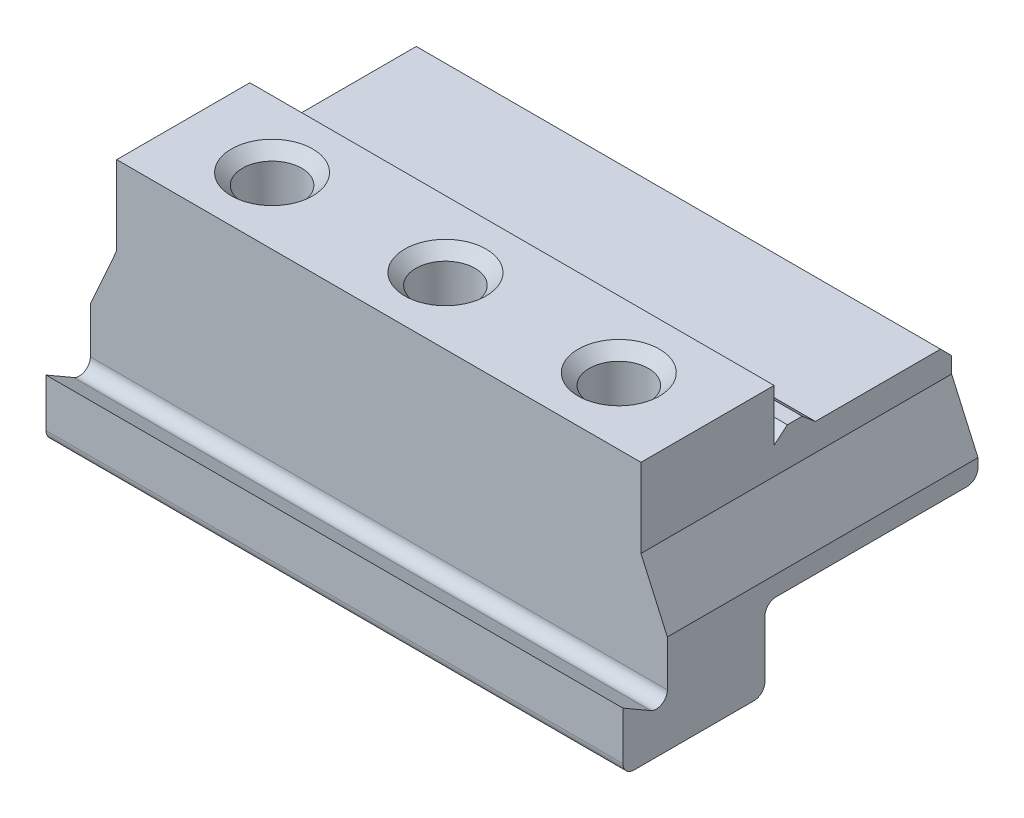
ISO-10303-21;
HEADER;
FILE_DESCRIPTION(('STEP AP214'),'2;1');
FILE_NAME('part.step','',(''),(''),'','','');
FILE_SCHEMA(('AUTOMOTIVE_DESIGN { 1 0 10303 214 1 1 1 1 }'));
ENDSEC;
DATA;
#1=APPLICATION_CONTEXT('core data for automotive mechanical design processes');
#2=APPLICATION_PROTOCOL_DEFINITION('international standard','automotive_design',2000,#1);
#3=PRODUCT_CONTEXT('',#1,'mechanical');
#4=PRODUCT('Part','Part','',(#3));
#5=PRODUCT_RELATED_PRODUCT_CATEGORY('part','',(#4));
#6=PRODUCT_DEFINITION_FORMATION('','',#4);
#7=PRODUCT_DEFINITION_CONTEXT('part definition',#1,'design');
#8=PRODUCT_DEFINITION('design','',#6,#7);
#9=PRODUCT_DEFINITION_SHAPE('','',#8);
#10=(LENGTH_UNIT() NAMED_UNIT(*) SI_UNIT(.MILLI.,.METRE.));
#11=(NAMED_UNIT(*) PLANE_ANGLE_UNIT() SI_UNIT($,.RADIAN.));
#12=(NAMED_UNIT(*) SI_UNIT($,.STERADIAN.) SOLID_ANGLE_UNIT());
#13=UNCERTAINTY_MEASURE_WITH_UNIT(LENGTH_MEASURE(1.E-05),#10,'distance_accuracy_value','');
#14=(GEOMETRIC_REPRESENTATION_CONTEXT(3) GLOBAL_UNCERTAINTY_ASSIGNED_CONTEXT((#13)) GLOBAL_UNIT_ASSIGNED_CONTEXT((#10,
#11,#12)) REPRESENTATION_CONTEXT('',''));
#15=CARTESIAN_POINT('',(0.,0.,0.));
#16=DIRECTION('',(0.,0.,1.));
#17=DIRECTION('',(1.,0.,0.));
#18=AXIS2_PLACEMENT_3D('',#15,#16,#17);
#19=CARTESIAN_POINT('',(78.,8.,0.));
#20=DIRECTION('',(0.,-0.866025403784436,0.500000000000004));
#21=DIRECTION('',(0.,-0.500000000000004,-0.866025403784436));
#22=AXIS2_PLACEMENT_3D('',#19,#20,#21);
#23=PLANE('',#22);
#24=DIRECTION('',(0.,0.500000000000004,0.866025403784436));
#25=VECTOR('',#24,1.);
#26=CARTESIAN_POINT('',(0.,8.,0.));
#27=LINE('',#26,#25);
#28=CARTESIAN_POINT('',(0.,5.83493649053888,-3.75));
#29=VERTEX_POINT('',#28);
#30=CARTESIAN_POINT('',(0.,8.,0.));
#31=VERTEX_POINT('',#30);
#32=EDGE_CURVE('E558',#29,#31,#27,.T.);
#33=ORIENTED_EDGE('',*,*,#32,.T.);
#34=DIRECTION('',(-1.,0.,0.));
#35=VECTOR('',#34,1.);
#36=CARTESIAN_POINT('',(78.,8.,0.));
#37=LINE('',#36,#35);
#38=CARTESIAN_POINT('',(78.,8.,0.));
#39=VERTEX_POINT('',#38);
#40=EDGE_CURVE('E297',#39,#31,#37,.T.);
#41=ORIENTED_EDGE('',*,*,#40,.F.);
#42=DIRECTION('',(0.,0.500000000000004,0.866025403784436));
#43=VECTOR('',#42,1.);
#44=CARTESIAN_POINT('',(78.,8.,0.));
#45=LINE('',#44,#43);
#46=CARTESIAN_POINT('',(78.,5.83493649053888,-3.75));
#47=VERTEX_POINT('',#46);
#48=EDGE_CURVE('E559',#47,#39,#45,.T.);
#49=ORIENTED_EDGE('',*,*,#48,.F.);
#50=DIRECTION('',(-1.,0.,0.));
#51=VECTOR('',#50,1.);
#52=CARTESIAN_POINT('',(78.,5.83493649053888,-3.75));
#53=LINE('',#52,#51);
#54=EDGE_CURVE('E238',#47,#29,#53,.T.);
#55=ORIENTED_EDGE('',*,*,#54,.T.);
#56=EDGE_LOOP('',(#33,#41,#49,#55));
#57=FACE_BOUND('',#56,.T.);
#58=ADVANCED_FACE('F45',(#57),#23,.F.);
#59=CARTESIAN_POINT('',(78.,1.50000000000001,0.));
#60=DIRECTION('',(0.,0.,-1.));
#61=DIRECTION('',(-1.,0.,0.));
#62=AXIS2_PLACEMENT_3D('',#59,#60,#61);
#63=PLANE('',#62);
#64=DIRECTION('',(0.,-1.,0.));
#65=VECTOR('',#64,1.);
#66=CARTESIAN_POINT('',(0.,1.50000000000001,0.));
#67=LINE('',#66,#65);
#68=CARTESIAN_POINT('',(0.,1.50000000000001,0.));
#69=VERTEX_POINT('',#68);
#70=EDGE_CURVE('E600',#31,#69,#67,.T.);
#71=ORIENTED_EDGE('',*,*,#70,.T.);
#72=DIRECTION('',(-1.,0.,0.));
#73=VECTOR('',#72,1.);
#74=CARTESIAN_POINT('',(78.,1.50000000000001,0.));
#75=LINE('',#74,#73);
#76=CARTESIAN_POINT('',(78.,1.50000000000001,0.));
#77=VERTEX_POINT('',#76);
#78=EDGE_CURVE('E293',#77,#69,#75,.T.);
#79=ORIENTED_EDGE('',*,*,#78,.F.);
#80=DIRECTION('',(0.,-1.,0.));
#81=VECTOR('',#80,1.);
#82=CARTESIAN_POINT('',(78.,1.50000000000001,0.));
#83=LINE('',#82,#81);
#84=EDGE_CURVE('E563',#39,#77,#83,.T.);
#85=ORIENTED_EDGE('',*,*,#84,.F.);
#86=ORIENTED_EDGE('',*,*,#40,.T.);
#87=EDGE_LOOP('',(#71,#79,#85,#86));
#88=FACE_BOUND('',#87,.T.);
#89=ADVANCED_FACE('F344',(#88),#63,.F.);
#90=CARTESIAN_POINT('',(78.,1.5,-1.5));
#91=DIRECTION('',(-1.,0.,0.));
#92=DIRECTION('',(0.,0.,1.));
#93=AXIS2_PLACEMENT_3D('',#90,#91,#92);
#94=CYLINDRICAL_SURFACE('',#93,1.5);
#95=CARTESIAN_POINT('',(0.,1.5,-1.5));
#96=DIRECTION('',(1.,0.,0.));
#97=DIRECTION('',(0.,0.,-1.));
#98=AXIS2_PLACEMENT_3D('',#95,#96,#97);
#99=CIRCLE('',#98,1.5);
#100=CARTESIAN_POINT('',(0.,0.,-1.50000000000001));
#101=VERTEX_POINT('',#100);
#102=EDGE_CURVE('E603',#69,#101,#99,.T.);
#103=ORIENTED_EDGE('',*,*,#102,.T.);
#104=DIRECTION('',(-1.,0.,0.));
#105=VECTOR('',#104,1.);
#106=CARTESIAN_POINT('',(78.,0.,-1.50000000000001));
#107=LINE('',#106,#105);
#108=CARTESIAN_POINT('',(78.,0.,-1.50000000000001));
#109=VERTEX_POINT('',#108);
#110=EDGE_CURVE('E289',#109,#101,#107,.T.);
#111=ORIENTED_EDGE('',*,*,#110,.F.);
#112=CARTESIAN_POINT('',(78.,1.5,-1.5));
#113=DIRECTION('',(1.,0.,0.));
#114=DIRECTION('',(0.,0.,-1.));
#115=AXIS2_PLACEMENT_3D('',#112,#113,#114);
#116=CIRCLE('',#115,1.5);
#117=EDGE_CURVE('E567',#77,#109,#116,.T.);
#118=ORIENTED_EDGE('',*,*,#117,.F.);
#119=ORIENTED_EDGE('',*,*,#78,.T.);
#120=EDGE_LOOP('',(#103,#111,#118,#119));
#121=FACE_BOUND('',#120,.T.);
#122=ADVANCED_FACE('F350',(#121),#94,.T.);
#123=CARTESIAN_POINT('',(78.,0.,-1.50000000000001));
#124=DIRECTION('',(0.,1.,0.));
#125=DIRECTION('',(0.,0.,1.));
#126=AXIS2_PLACEMENT_3D('',#123,#124,#125);
#127=PLANE('',#126);
#128=DIRECTION('',(0.,0.,-1.));
#129=VECTOR('',#128,1.);
#130=CARTESIAN_POINT('',(0.,0.,-1.50000000000001));
#131=LINE('',#130,#129);
#132=CARTESIAN_POINT('',(0.,0.,-17.7));
#133=VERTEX_POINT('',#132);
#134=EDGE_CURVE('E606',#101,#133,#131,.T.);
#135=ORIENTED_EDGE('',*,*,#134,.T.);
#136=DIRECTION('',(-1.,0.,0.));
#137=VECTOR('',#136,1.);
#138=CARTESIAN_POINT('',(78.,0.,-17.7));
#139=LINE('',#138,#137);
#140=CARTESIAN_POINT('',(78.,0.,-17.7));
#141=VERTEX_POINT('',#140);
#142=EDGE_CURVE('E285',#141,#133,#139,.T.);
#143=ORIENTED_EDGE('',*,*,#142,.F.);
#144=DIRECTION('',(0.,0.,-1.));
#145=VECTOR('',#144,1.);
#146=CARTESIAN_POINT('',(78.,0.,-1.50000000000001));
#147=LINE('',#146,#145);
#148=EDGE_CURVE('E570',#109,#141,#147,.T.);
#149=ORIENTED_EDGE('',*,*,#148,.F.);
#150=ORIENTED_EDGE('',*,*,#110,.T.);
#151=EDGE_LOOP('',(#135,#143,#149,#150));
#152=FACE_BOUND('',#151,.T.);
#153=ADVANCED_FACE('F364',(#152),#127,.F.);
#154=CARTESIAN_POINT('',(78.,1.5,-17.7));
#155=DIRECTION('',(-1.,0.,0.));
#156=DIRECTION('',(0.,0.,1.));
#157=AXIS2_PLACEMENT_3D('',#154,#155,#156);
#158=CYLINDRICAL_SURFACE('',#157,1.5);
#159=CARTESIAN_POINT('',(0.,1.5,-17.7));
#160=DIRECTION('',(1.,0.,0.));
#161=DIRECTION('',(0.,0.,-1.));
#162=AXIS2_PLACEMENT_3D('',#159,#160,#161);
#163=CIRCLE('',#162,1.5);
#164=CARTESIAN_POINT('',(0.,1.5,-19.2));
#165=VERTEX_POINT('',#164);
#166=EDGE_CURVE('E609',#133,#165,#163,.T.);
#167=ORIENTED_EDGE('',*,*,#166,.T.);
#168=DIRECTION('',(-1.,0.,0.));
#169=VECTOR('',#168,1.);
#170=CARTESIAN_POINT('',(78.,1.5,-19.2));
#171=LINE('',#170,#169);
#172=CARTESIAN_POINT('',(78.,1.5,-19.2));
#173=VERTEX_POINT('',#172);
#174=EDGE_CURVE('E281',#173,#165,#171,.T.);
#175=ORIENTED_EDGE('',*,*,#174,.F.);
#176=CARTESIAN_POINT('',(78.,1.5,-17.7));
#177=DIRECTION('',(1.,0.,0.));
#178=DIRECTION('',(0.,0.,-1.));
#179=AXIS2_PLACEMENT_3D('',#176,#177,#178);
#180=CIRCLE('',#179,1.5);
#181=EDGE_CURVE('E573',#141,#173,#180,.T.);
#182=ORIENTED_EDGE('',*,*,#181,.F.);
#183=ORIENTED_EDGE('',*,*,#142,.T.);
#184=EDGE_LOOP('',(#167,#175,#182,#183));
#185=FACE_BOUND('',#184,.T.);
#186=ADVANCED_FACE('F368',(#185),#158,.T.);
#187=CARTESIAN_POINT('',(78.,1.50000000000001,-19.2));
#188=DIRECTION('',(0.,0.,1.));
#189=DIRECTION('',(1.,0.,0.));
#190=AXIS2_PLACEMENT_3D('',#187,#188,#189);
#191=PLANE('',#190);
#192=DIRECTION('',(0.,1.,0.));
#193=VECTOR('',#192,1.);
#194=CARTESIAN_POINT('',(0.,1.50000000000001,-19.2));
#195=LINE('',#194,#193);
#196=CARTESIAN_POINT('',(0.,9.16999999999999,-19.2));
#197=VERTEX_POINT('',#196);
#198=EDGE_CURVE('E612',#165,#197,#195,.T.);
#199=ORIENTED_EDGE('',*,*,#198,.T.);
#200=DIRECTION('',(-1.,0.,0.));
#201=VECTOR('',#200,1.);
#202=CARTESIAN_POINT('',(78.,9.16999999999999,-19.2));
#203=LINE('',#202,#201);
#204=CARTESIAN_POINT('',(78.,9.16999999999999,-19.2));
#205=VERTEX_POINT('',#204);
#206=EDGE_CURVE('E277',#205,#197,#203,.T.);
#207=ORIENTED_EDGE('',*,*,#206,.F.);
#208=DIRECTION('',(0.,1.,0.));
#209=VECTOR('',#208,1.);
#210=CARTESIAN_POINT('',(78.,1.50000000000001,-19.2));
#211=LINE('',#210,#209);
#212=EDGE_CURVE('E576',#173,#205,#211,.T.);
#213=ORIENTED_EDGE('',*,*,#212,.F.);
#214=ORIENTED_EDGE('',*,*,#174,.T.);
#215=EDGE_LOOP('',(#199,#207,#213,#214));
#216=FACE_BOUND('',#215,.T.);
#217=ADVANCED_FACE('F372',(#216),#191,.F.);
#218=CARTESIAN_POINT('',(78.,9.17,-20.7));
#219=DIRECTION('',(-1.,0.,0.));
#220=DIRECTION('',(0.,0.,1.));
#221=AXIS2_PLACEMENT_3D('',#218,#219,#220);
#222=CYLINDRICAL_SURFACE('',#221,1.5);
#223=CARTESIAN_POINT('',(0.,9.17,-20.7));
#224=DIRECTION('',(-1.,0.,0.));
#225=DIRECTION('',(0.,0.,1.));
#226=AXIS2_PLACEMENT_3D('',#223,#224,#225);
#227=CIRCLE('',#226,1.5);
#228=CARTESIAN_POINT('',(0.,10.67,-20.7));
#229=VERTEX_POINT('',#228);
#230=EDGE_CURVE('E615',#197,#229,#227,.T.);
#231=ORIENTED_EDGE('',*,*,#230,.T.);
#232=DIRECTION('',(-1.,0.,0.));
#233=VECTOR('',#232,1.);
#234=CARTESIAN_POINT('',(78.,10.67,-20.7));
#235=LINE('',#234,#233);
#236=CARTESIAN_POINT('',(78.,10.67,-20.7));
#237=VERTEX_POINT('',#236);
#238=EDGE_CURVE('E273',#237,#229,#235,.T.);
#239=ORIENTED_EDGE('',*,*,#238,.F.);
#240=CARTESIAN_POINT('',(78.,9.17,-20.7));
#241=DIRECTION('',(-1.,0.,0.));
#242=DIRECTION('',(0.,0.,1.));
#243=AXIS2_PLACEMENT_3D('',#240,#241,#242);
#244=CIRCLE('',#243,1.5);
#245=EDGE_CURVE('E579',#205,#237,#244,.T.);
#246=ORIENTED_EDGE('',*,*,#245,.F.);
#247=ORIENTED_EDGE('',*,*,#206,.T.);
#248=EDGE_LOOP('',(#231,#239,#246,#247));
#249=FACE_BOUND('',#248,.T.);
#250=ADVANCED_FACE('F376',(#249),#222,.F.);
#251=CARTESIAN_POINT('',(78.,10.67,-20.7));
#252=DIRECTION('',(0.,1.,0.));
#253=DIRECTION('',(0.,0.,1.));
#254=AXIS2_PLACEMENT_3D('',#251,#252,#253);
#255=PLANE('',#254);
#256=DIRECTION('',(0.,0.,-1.));
#257=VECTOR('',#256,1.);
#258=CARTESIAN_POINT('',(0.,10.67,-20.7));
#259=LINE('',#258,#257);
#260=CARTESIAN_POINT('',(0.,10.67,-46.5));
#261=VERTEX_POINT('',#260);
#262=EDGE_CURVE('E618',#229,#261,#259,.T.);
#263=ORIENTED_EDGE('',*,*,#262,.T.);
#264=DIRECTION('',(-1.,0.,0.));
#265=VECTOR('',#264,1.);
#266=CARTESIAN_POINT('',(78.,10.67,-46.5));
#267=LINE('',#266,#265);
#268=CARTESIAN_POINT('',(78.,10.67,-46.5));
#269=VERTEX_POINT('',#268);
#270=EDGE_CURVE('E269',#269,#261,#267,.T.);
#271=ORIENTED_EDGE('',*,*,#270,.F.);
#272=DIRECTION('',(0.,0.,-1.));
#273=VECTOR('',#272,1.);
#274=CARTESIAN_POINT('',(78.,10.67,-20.7));
#275=LINE('',#274,#273);
#276=EDGE_CURVE('E582',#237,#269,#275,.T.);
#277=ORIENTED_EDGE('',*,*,#276,.F.);
#278=ORIENTED_EDGE('',*,*,#238,.T.);
#279=EDGE_LOOP('',(#263,#271,#277,#278));
#280=FACE_BOUND('',#279,.T.);
#281=ADVANCED_FACE('F380',(#280),#255,.F.);
#282=CARTESIAN_POINT('',(78.,12.17,-46.5));
#283=DIRECTION('',(-1.,0.,0.));
#284=DIRECTION('',(0.,0.,1.));
#285=AXIS2_PLACEMENT_3D('',#282,#283,#284);
#286=CYLINDRICAL_SURFACE('',#285,1.5);
#287=CARTESIAN_POINT('',(0.,12.17,-46.5));
#288=DIRECTION('',(1.,0.,0.));
#289=DIRECTION('',(0.,0.,-1.));
#290=AXIS2_PLACEMENT_3D('',#287,#288,#289);
#291=CIRCLE('',#290,1.5);
#292=CARTESIAN_POINT('',(0.,12.17,-48.));
#293=VERTEX_POINT('',#292);
#294=EDGE_CURVE('E621',#261,#293,#291,.T.);
#295=ORIENTED_EDGE('',*,*,#294,.T.);
#296=DIRECTION('',(-1.,0.,0.));
#297=VECTOR('',#296,1.);
#298=CARTESIAN_POINT('',(78.,12.17,-48.));
#299=LINE('',#298,#297);
#300=CARTESIAN_POINT('',(78.,12.17,-48.));
#301=VERTEX_POINT('',#300);
#302=EDGE_CURVE('E265',#301,#293,#299,.T.);
#303=ORIENTED_EDGE('',*,*,#302,.F.);
#304=CARTESIAN_POINT('',(78.,12.17,-46.5));
#305=DIRECTION('',(1.,0.,0.));
#306=DIRECTION('',(0.,0.,-1.));
#307=AXIS2_PLACEMENT_3D('',#304,#305,#306);
#308=CIRCLE('',#307,1.5);
#309=EDGE_CURVE('E585',#269,#301,#308,.T.);
#310=ORIENTED_EDGE('',*,*,#309,.F.);
#311=ORIENTED_EDGE('',*,*,#270,.T.);
#312=EDGE_LOOP('',(#295,#303,#310,#311));
#313=FACE_BOUND('',#312,.T.);
#314=ADVANCED_FACE('F384',(#313),#286,.T.);
#315=CARTESIAN_POINT('',(78.,23.5,-48.));
#316=DIRECTION('',(0.,0.,1.));
#317=DIRECTION('',(1.,0.,0.));
#318=AXIS2_PLACEMENT_3D('',#315,#316,#317);
#319=PLANE('',#318);
#320=DIRECTION('',(0.,-1.,0.));
#321=VECTOR('',#320,1.);
#322=CARTESIAN_POINT('',(74.4381705175318,23.5,-48.));
#323=LINE('',#322,#321);
#324=CARTESIAN_POINT('',(74.4381705175318,23.5,-48.));
#325=VERTEX_POINT('',#324);
#326=CARTESIAN_POINT('',(74.4381705175318,21.33,-48.));
#327=VERTEX_POINT('',#326);
#328=EDGE_CURVE('E554',#325,#327,#323,.T.);
#329=ORIENTED_EDGE('',*,*,#328,.T.);
#330=DIRECTION('',(0.406736643075794,-0.913545457642604,0.));
#331=VECTOR('',#330,1.);
#332=CARTESIAN_POINT('',(74.2211085624476,21.8175291333349,-48.));
#333=LINE('',#332,#331);
#334=CARTESIAN_POINT('',(78.0000000000001,13.33,-48.));
#335=VERTEX_POINT('',#334);
#336=EDGE_CURVE('E500',#327,#335,#333,.T.);
#337=ORIENTED_EDGE('',*,*,#336,.T.);
#338=DIRECTION('',(0.,1.,0.));
#339=VECTOR('',#338,1.);
#340=CARTESIAN_POINT('',(78.,23.5,-48.));
#341=LINE('',#340,#339);
#342=EDGE_CURVE('E588',#301,#335,#341,.T.);
#343=ORIENTED_EDGE('',*,*,#342,.F.);
#344=ORIENTED_EDGE('',*,*,#302,.T.);
#345=DIRECTION('',(0.,1.,0.));
#346=VECTOR('',#345,1.);
#347=CARTESIAN_POINT('',(0.,23.5,-48.));
#348=LINE('',#347,#346);
#349=CARTESIAN_POINT('',(0.,13.33,-48.));
#350=VERTEX_POINT('',#349);
#351=EDGE_CURVE('E624',#293,#350,#348,.T.);
#352=ORIENTED_EDGE('',*,*,#351,.T.);
#353=DIRECTION('',(0.406736643075794,0.913545457642604,0.));
#354=VECTOR('',#353,1.);
#355=CARTESIAN_POINT('',(16.6827977895566,50.8001773269529,-48.));
#356=LINE('',#355,#354);
#357=CARTESIAN_POINT('',(3.56182948246821,21.33,-48.));
#358=VERTEX_POINT('',#357);
#359=EDGE_CURVE('E70',#350,#358,#356,.T.);
#360=ORIENTED_EDGE('',*,*,#359,.T.);
#361=DIRECTION('',(0.,1.,0.));
#362=VECTOR('',#361,1.);
#363=CARTESIAN_POINT('',(3.56182948246821,23.5,-48.));
#364=LINE('',#363,#362);
#365=CARTESIAN_POINT('',(3.56182948246821,23.5,-48.));
#366=VERTEX_POINT('',#365);
#367=EDGE_CURVE('E528',#358,#366,#364,.T.);
#368=ORIENTED_EDGE('',*,*,#367,.T.);
#369=DIRECTION('',(-1.,0.,0.));
#370=VECTOR('',#369,1.);
#371=CARTESIAN_POINT('',(78.,23.5,-48.));
#372=LINE('',#371,#370);
#373=EDGE_CURVE('E261',#325,#366,#372,.T.);
#374=ORIENTED_EDGE('',*,*,#373,.F.);
#375=EDGE_LOOP('',(#329,#337,#343,#344,#352,#360,#368,#374));
#376=FACE_BOUND('',#375,.T.);
#377=ADVANCED_FACE('F388',(#376),#319,.F.);
#378=CARTESIAN_POINT('',(78.,25.,-46.5));
#379=DIRECTION('',(0.,-0.707106781186547,0.707106781186547));
#380=DIRECTION('',(0.,-0.707106781186548,-0.707106781186548));
#381=AXIS2_PLACEMENT_3D('',#378,#379,#380);
#382=PLANE('',#381);
#383=DIRECTION('',(-1.,0.,0.));
#384=VECTOR('',#383,1.);
#385=CARTESIAN_POINT('',(78.,25.,-46.5));
#386=LINE('',#385,#384);
#387=CARTESIAN_POINT('',(74.4381705175318,25.,-46.5));
#388=VERTEX_POINT('',#387);
#389=CARTESIAN_POINT('',(3.56182948246821,25.,-46.5));
#390=VERTEX_POINT('',#389);
#391=EDGE_CURVE('E257',#388,#390,#386,.T.);
#392=ORIENTED_EDGE('',*,*,#391,.F.);
#393=DIRECTION('',(0.,-0.707106781186548,-0.707106781186548));
#394=VECTOR('',#393,1.);
#395=CARTESIAN_POINT('',(74.4381705175318,25.,-46.5));
#396=LINE('',#395,#394);
#397=EDGE_CURVE('E550',#388,#325,#396,.T.);
#398=ORIENTED_EDGE('',*,*,#397,.T.);
#399=ORIENTED_EDGE('',*,*,#373,.T.);
#400=DIRECTION('',(0.,0.707106781186548,0.707106781186548));
#401=VECTOR('',#400,1.);
#402=CARTESIAN_POINT('',(3.56182948246821,25.,-46.5));
#403=LINE('',#402,#401);
#404=EDGE_CURVE('E524',#366,#390,#403,.T.);
#405=ORIENTED_EDGE('',*,*,#404,.T.);
#406=EDGE_LOOP('',(#392,#398,#399,#405));
#407=FACE_BOUND('',#406,.T.);
#408=ADVANCED_FACE('F392',(#407),#382,.F.);
#409=CARTESIAN_POINT('',(78.,25.,-29.5752607777826));
#410=DIRECTION('',(0.,-1.,0.));
#411=DIRECTION('',(0.,0.,-1.));
#412=AXIS2_PLACEMENT_3D('',#409,#410,#411);
#413=PLANE('',#412);
#414=DIRECTION('',(-1.,0.,0.));
#415=VECTOR('',#414,1.);
#416=CARTESIAN_POINT('',(78.,25.,-29.5752607777826));
#417=LINE('',#416,#415);
#418=CARTESIAN_POINT('',(74.4381705175318,25.,-29.5752607777826));
#419=VERTEX_POINT('',#418);
#420=CARTESIAN_POINT('',(3.56182948246821,25.,-29.5752607777826));
#421=VERTEX_POINT('',#420);
#422=EDGE_CURVE('E253',#419,#421,#417,.T.);
#423=ORIENTED_EDGE('',*,*,#422,.F.);
#424=DIRECTION('',(0.,0.,-1.));
#425=VECTOR('',#424,1.);
#426=CARTESIAN_POINT('',(74.4381705175318,25.,-29.5752607777826));
#427=LINE('',#426,#425);
#428=EDGE_CURVE('E546',#419,#388,#427,.T.);
#429=ORIENTED_EDGE('',*,*,#428,.T.);
#430=ORIENTED_EDGE('',*,*,#391,.T.);
#431=DIRECTION('',(0.,0.,1.));
#432=VECTOR('',#431,1.);
#433=CARTESIAN_POINT('',(3.56182948246821,25.,-29.5752607777826));
#434=LINE('',#433,#432);
#435=EDGE_CURVE('E520',#390,#421,#434,.T.);
#436=ORIENTED_EDGE('',*,*,#435,.T.);
#437=EDGE_LOOP('',(#423,#429,#430,#436));
#438=FACE_BOUND('',#437,.T.);
#439=ADVANCED_FACE('F396',(#438),#413,.F.);
#440=CARTESIAN_POINT('',(78.,26.5,-27.7876303888913));
#441=DIRECTION('',(0.,-0.766044443118977,0.64278760968654));
#442=DIRECTION('',(0.,-0.64278760968654,-0.766044443118977));
#443=AXIS2_PLACEMENT_3D('',#440,#441,#442);
#444=PLANE('',#443);
#445=DIRECTION('',(-1.,0.,0.));
#446=VECTOR('',#445,1.);
#447=CARTESIAN_POINT('',(78.,26.5,-27.7876303888913));
#448=LINE('',#447,#446);
#449=CARTESIAN_POINT('',(74.4381705175318,26.5,-27.7876303888913));
#450=VERTEX_POINT('',#449);
#451=CARTESIAN_POINT('',(3.56182948246821,26.5,-27.7876303888913));
#452=VERTEX_POINT('',#451);
#453=EDGE_CURVE('E249',#450,#452,#448,.T.);
#454=ORIENTED_EDGE('',*,*,#453,.F.);
#455=DIRECTION('',(0.,-0.64278760968654,-0.766044443118977));
#456=VECTOR('',#455,1.);
#457=CARTESIAN_POINT('',(74.4381705175318,26.5,-27.7876303888913));
#458=LINE('',#457,#456);
#459=EDGE_CURVE('E542',#450,#419,#458,.T.);
#460=ORIENTED_EDGE('',*,*,#459,.T.);
#461=ORIENTED_EDGE('',*,*,#422,.T.);
#462=DIRECTION('',(0.,0.64278760968654,0.766044443118977));
#463=VECTOR('',#462,1.);
#464=CARTESIAN_POINT('',(3.56182948246821,26.5,-27.7876303888913));
#465=LINE('',#464,#463);
#466=EDGE_CURVE('E516',#421,#452,#465,.T.);
#467=ORIENTED_EDGE('',*,*,#466,.T.);
#468=EDGE_LOOP('',(#454,#460,#461,#467));
#469=FACE_BOUND('',#468,.T.);
#470=ADVANCED_FACE('F400',(#469),#444,.F.);
#471=CARTESIAN_POINT('',(78.,26.5,-25.7876303888913));
#472=DIRECTION('',(0.,-1.,0.));
#473=DIRECTION('',(0.,0.,-1.));
#474=AXIS2_PLACEMENT_3D('',#471,#472,#473);
#475=PLANE('',#474);
#476=DIRECTION('',(-1.,0.,0.));
#477=VECTOR('',#476,1.);
#478=CARTESIAN_POINT('',(78.,26.5,-25.7876303888913));
#479=LINE('',#478,#477);
#480=CARTESIAN_POINT('',(74.4381705175318,26.5,-25.7876303888913));
#481=VERTEX_POINT('',#480);
#482=CARTESIAN_POINT('',(3.56182948246821,26.5,-25.7876303888913));
#483=VERTEX_POINT('',#482);
#484=EDGE_CURVE('E245',#481,#483,#479,.T.);
#485=ORIENTED_EDGE('',*,*,#484,.F.);
#486=DIRECTION('',(0.,0.,-1.));
#487=VECTOR('',#486,1.);
#488=CARTESIAN_POINT('',(74.4381705175318,26.5,-25.7876303888913));
#489=LINE('',#488,#487);
#490=EDGE_CURVE('E538',#481,#450,#489,.T.);
#491=ORIENTED_EDGE('',*,*,#490,.T.);
#492=ORIENTED_EDGE('',*,*,#453,.T.);
#493=DIRECTION('',(0.,0.,1.));
#494=VECTOR('',#493,1.);
#495=CARTESIAN_POINT('',(3.56182948246821,26.5,-25.7876303888913));
#496=LINE('',#495,#494);
#497=EDGE_CURVE('E512',#452,#483,#496,.T.);
#498=ORIENTED_EDGE('',*,*,#497,.T.);
#499=EDGE_LOOP('',(#485,#491,#492,#498));
#500=FACE_BOUND('',#499,.T.);
#501=ADVANCED_FACE('F404',(#500),#475,.F.);
#502=CARTESIAN_POINT('',(78.,25.,-24.));
#503=DIRECTION('',(0.,-0.766044443118979,-0.642787609686538));
#504=DIRECTION('',(0.,0.642787609686538,-0.766044443118979));
#505=AXIS2_PLACEMENT_3D('',#502,#503,#504);
#506=PLANE('',#505);
#507=DIRECTION('',(-1.,0.,0.));
#508=VECTOR('',#507,1.);
#509=CARTESIAN_POINT('',(78.,25.,-24.));
#510=LINE('',#509,#508);
#511=CARTESIAN_POINT('',(74.4381705175318,25.,-24.));
#512=VERTEX_POINT('',#511);
#513=CARTESIAN_POINT('',(3.56182948246821,25.,-24.));
#514=VERTEX_POINT('',#513);
#515=EDGE_CURVE('E235',#512,#514,#510,.T.);
#516=ORIENTED_EDGE('',*,*,#515,.F.);
#517=DIRECTION('',(0.,0.642787609686538,-0.766044443118979));
#518=VECTOR('',#517,1.);
#519=CARTESIAN_POINT('',(74.4381705175318,25.,-24.));
#520=LINE('',#519,#518);
#521=EDGE_CURVE('E534',#512,#481,#520,.T.);
#522=ORIENTED_EDGE('',*,*,#521,.T.);
#523=ORIENTED_EDGE('',*,*,#484,.T.);
#524=DIRECTION('',(0.,-0.642787609686538,0.766044443118979));
#525=VECTOR('',#524,1.);
#526=CARTESIAN_POINT('',(3.56182948246821,25.,-24.));
#527=LINE('',#526,#525);
#528=EDGE_CURVE('E508',#483,#514,#527,.T.);
#529=ORIENTED_EDGE('',*,*,#528,.T.);
#530=EDGE_LOOP('',(#516,#522,#523,#529));
#531=FACE_BOUND('',#530,.T.);
#532=ADVANCED_FACE('F408',(#531),#506,.F.);
#533=CARTESIAN_POINT('',(78.,32.,-24.));
#534=DIRECTION('',(0.,0.,1.));
#535=DIRECTION('',(1.,0.,0.));
#536=AXIS2_PLACEMENT_3D('',#533,#534,#535);
#537=PLANE('',#536);
#538=DIRECTION('',(-1.,0.,0.));
#539=VECTOR('',#538,1.);
#540=CARTESIAN_POINT('',(78.,32.,-24.));
#541=LINE('',#540,#539);
#542=CARTESIAN_POINT('',(74.4381705175318,32.,-24.));
#543=VERTEX_POINT('',#542);
#544=CARTESIAN_POINT('',(3.56182948246821,32.,-24.));
#545=VERTEX_POINT('',#544);
#546=EDGE_CURVE('E230',#543,#545,#541,.T.);
#547=ORIENTED_EDGE('',*,*,#546,.F.);
#548=DIRECTION('',(0.,-1.,0.));
#549=VECTOR('',#548,1.);
#550=CARTESIAN_POINT('',(74.4381705175318,32.,-24.));
#551=LINE('',#550,#549);
#552=EDGE_CURVE('E209',#543,#512,#551,.T.);
#553=ORIENTED_EDGE('',*,*,#552,.T.);
#554=ORIENTED_EDGE('',*,*,#515,.T.);
#555=DIRECTION('',(0.,1.,0.));
#556=VECTOR('',#555,1.);
#557=CARTESIAN_POINT('',(3.56182948246821,32.,-24.));
#558=LINE('',#557,#556);
#559=EDGE_CURVE('E504',#514,#545,#558,.T.);
#560=ORIENTED_EDGE('',*,*,#559,.T.);
#561=EDGE_LOOP('',(#547,#553,#554,#560));
#562=FACE_BOUND('',#561,.T.);
#563=ADVANCED_FACE('F412',(#562),#537,.F.);
#564=CARTESIAN_POINT('',(78.,32.,-6.));
#565=DIRECTION('',(0.,-1.,0.));
#566=DIRECTION('',(0.,0.,-1.));
#567=AXIS2_PLACEMENT_3D('',#564,#565,#566);
#568=PLANE('',#567);
#569=CARTESIAN_POINT('',(62.4381705175318,32.,-15.));
#570=DIRECTION('',(0.,-1.,0.));
#571=DIRECTION('',(0.,0.,-1.));
#572=AXIS2_PLACEMENT_3D('',#569,#570,#571);
#573=CIRCLE('',#572,5.50000000000004);
#574=CARTESIAN_POINT('',(62.4381705175318,32.,-20.5));
#575=VERTEX_POINT('',#574);
#576=EDGE_CURVE('E319',#575,#575,#573,.T.);
#577=ORIENTED_EDGE('',*,*,#576,.T.);
#578=EDGE_LOOP('',(#577));
#579=FACE_BOUND('',#578,.T.);
#580=CARTESIAN_POINT('',(39.,32.,-15.));
#581=DIRECTION('',(0.,-1.,0.));
#582=DIRECTION('',(0.,0.,-1.));
#583=AXIS2_PLACEMENT_3D('',#580,#581,#582);
#584=CIRCLE('',#583,5.50000000000001);
#585=CARTESIAN_POINT('',(39.,32.,-20.5));
#586=VERTEX_POINT('',#585);
#587=EDGE_CURVE('E315',#586,#586,#584,.T.);
#588=ORIENTED_EDGE('',*,*,#587,.T.);
#589=EDGE_LOOP('',(#588));
#590=FACE_BOUND('',#589,.T.);
#591=CARTESIAN_POINT('',(15.5618294824682,32.,-15.));
#592=DIRECTION('',(0.,-1.,0.));
#593=DIRECTION('',(0.,0.,-1.));
#594=AXIS2_PLACEMENT_3D('',#591,#592,#593);
#595=CIRCLE('',#594,5.5);
#596=CARTESIAN_POINT('',(15.5618294824682,32.,-20.5));
#597=VERTEX_POINT('',#596);
#598=EDGE_CURVE('E311',#597,#597,#595,.T.);
#599=ORIENTED_EDGE('',*,*,#598,.T.);
#600=EDGE_LOOP('',(#599));
#601=FACE_BOUND('',#600,.T.);
#602=DIRECTION('',(-1.,0.,0.));
#603=VECTOR('',#602,1.);
#604=CARTESIAN_POINT('',(78.,32.,-6.));
#605=LINE('',#604,#603);
#606=CARTESIAN_POINT('',(74.4381705175318,32.,-6.00000000000001));
#607=VERTEX_POINT('',#606);
#608=CARTESIAN_POINT('',(3.56182948246821,32.,-6.00000000000001));
#609=VERTEX_POINT('',#608);
#610=EDGE_CURVE('E222',#607,#609,#605,.T.);
#611=ORIENTED_EDGE('',*,*,#610,.F.);
#612=DIRECTION('',(0.,0.,1.));
#613=VECTOR('',#612,1.);
#614=CARTESIAN_POINT('',(74.4381705175318,32.,-84.));
#615=LINE('',#614,#613);
#616=EDGE_CURVE('E203',#543,#607,#615,.T.);
#617=ORIENTED_EDGE('',*,*,#616,.F.);
#618=ORIENTED_EDGE('',*,*,#546,.T.);
#619=DIRECTION('',(0.,0.,1.));
#620=VECTOR('',#619,1.);
#621=CARTESIAN_POINT('',(3.56182948246821,32.,-84.));
#622=LINE('',#621,#620);
#623=EDGE_CURVE('E228',#545,#609,#622,.T.);
#624=ORIENTED_EDGE('',*,*,#623,.T.);
#625=EDGE_LOOP('',(#611,#617,#618,#624));
#626=FACE_BOUND('',#625,.T.);
#627=ADVANCED_FACE('F227',(#579,#590,#601,#626),#568,.F.);
#628=CARTESIAN_POINT('',(78.,7.13397459621553,-6.00000000000001));
#629=DIRECTION('',(0.,0.,-1.));
#630=DIRECTION('',(0.,1.,0.));
#631=AXIS2_PLACEMENT_3D('',#628,#629,#630);
#632=PLANE('',#631);
#633=DIRECTION('',(0.,-1.,0.));
#634=VECTOR('',#633,1.);
#635=CARTESIAN_POINT('',(78.,7.13397459621553,-6.00000000000001));
#636=LINE('',#635,#634);
#637=CARTESIAN_POINT('',(78.,13.33,-6.));
#638=VERTEX_POINT('',#637);
#639=CARTESIAN_POINT('',(78.,7.13397459621553,-6.00000000000001));
#640=VERTEX_POINT('',#639);
#641=EDGE_CURVE('E592',#638,#640,#636,.T.);
#642=ORIENTED_EDGE('',*,*,#641,.F.);
#643=DIRECTION('',(0.406736643075794,-0.913545457642604,0.));
#644=VECTOR('',#643,1.);
#645=CARTESIAN_POINT('',(74.4381705175318,21.33,-6.00000000000001));
#646=LINE('',#645,#644);
#647=CARTESIAN_POINT('',(74.4381705175318,21.33,-6.00000000000001));
#648=VERTEX_POINT('',#647);
#649=EDGE_CURVE('E62',#648,#638,#646,.T.);
#650=ORIENTED_EDGE('',*,*,#649,.F.);
#651=DIRECTION('',(0.,-1.,0.));
#652=VECTOR('',#651,1.);
#653=CARTESIAN_POINT('',(74.4381705175318,32.,-6.00000000000001));
#654=LINE('',#653,#652);
#655=EDGE_CURVE('E207',#607,#648,#654,.T.);
#656=ORIENTED_EDGE('',*,*,#655,.F.);
#657=ORIENTED_EDGE('',*,*,#610,.T.);
#658=DIRECTION('',(0.,1.,0.));
#659=VECTOR('',#658,1.);
#660=CARTESIAN_POINT('',(3.56182948246821,32.,-6.00000000000001));
#661=LINE('',#660,#659);
#662=CARTESIAN_POINT('',(3.56182948246821,21.33,-6.00000000000001));
#663=VERTEX_POINT('',#662);
#664=EDGE_CURVE('E491',#663,#609,#661,.T.);
#665=ORIENTED_EDGE('',*,*,#664,.F.);
#666=DIRECTION('',(0.406736643075794,0.913545457642604,0.));
#667=VECTOR('',#666,1.);
#668=CARTESIAN_POINT('',(3.56182948246821,21.33,-6.00000000000001));
#669=LINE('',#668,#667);
#670=CARTESIAN_POINT('',(0.,13.33,-6.00000000000001));
#671=VERTEX_POINT('',#670);
#672=EDGE_CURVE('E224',#671,#663,#669,.T.);
#673=ORIENTED_EDGE('',*,*,#672,.F.);
#674=DIRECTION('',(0.,-1.,0.));
#675=VECTOR('',#674,1.);
#676=CARTESIAN_POINT('',(0.,7.13397459621553,-6.00000000000001));
#677=LINE('',#676,#675);
#678=CARTESIAN_POINT('',(0.,7.13397459621553,-6.00000000000001));
#679=VERTEX_POINT('',#678);
#680=EDGE_CURVE('E628',#671,#679,#677,.T.);
#681=ORIENTED_EDGE('',*,*,#680,.T.);
#682=DIRECTION('',(-1.,0.,0.));
#683=VECTOR('',#682,1.);
#684=CARTESIAN_POINT('',(78.,7.13397459621553,-6.00000000000001));
#685=LINE('',#684,#683);
#686=EDGE_CURVE('E231',#640,#679,#685,.T.);
#687=ORIENTED_EDGE('',*,*,#686,.F.);
#688=EDGE_LOOP('',(#642,#650,#656,#657,#665,#673,#681,#687));
#689=FACE_BOUND('',#688,.T.);
#690=ADVANCED_FACE('F220',(#689),#632,.F.);
#691=CARTESIAN_POINT('',(78.,7.13397459621553,-4.5));
#692=DIRECTION('',(-1.,0.,0.));
#693=DIRECTION('',(0.,0.,1.));
#694=AXIS2_PLACEMENT_3D('',#691,#692,#693);
#695=CYLINDRICAL_SURFACE('',#694,1.5);
#696=CARTESIAN_POINT('',(0.,7.13397459621553,-4.5));
#697=DIRECTION('',(-1.,0.,0.));
#698=DIRECTION('',(0.,0.,-1.));
#699=AXIS2_PLACEMENT_3D('',#696,#697,#698);
#700=CIRCLE('',#699,1.5);
#701=EDGE_CURVE('E564',#679,#29,#700,.T.);
#702=ORIENTED_EDGE('',*,*,#701,.T.);
#703=ORIENTED_EDGE('',*,*,#54,.F.);
#704=CARTESIAN_POINT('',(78.,7.13397459621553,-4.5));
#705=DIRECTION('',(-1.,0.,0.));
#706=DIRECTION('',(0.,0.,-1.));
#707=AXIS2_PLACEMENT_3D('',#704,#705,#706);
#708=CIRCLE('',#707,1.5);
#709=EDGE_CURVE('E595',#640,#47,#708,.T.);
#710=ORIENTED_EDGE('',*,*,#709,.F.);
#711=ORIENTED_EDGE('',*,*,#686,.T.);
#712=EDGE_LOOP('',(#702,#703,#710,#711));
#713=FACE_BOUND('',#712,.T.);
#714=ADVANCED_FACE('F422',(#713),#695,.F.);
#715=CARTESIAN_POINT('',(78.,7.13397459621553,-4.5));
#716=DIRECTION('',(1.,0.,0.));
#717=DIRECTION('',(0.,0.,-1.));
#718=AXIS2_PLACEMENT_3D('',#715,#716,#717);
#719=PLANE('',#718);
#720=DIRECTION('',(0.,0.,-1.));
#721=VECTOR('',#720,1.);
#722=CARTESIAN_POINT('',(78.,13.33,-4.5));
#723=LINE('',#722,#721);
#724=EDGE_CURVE('E304',#638,#335,#723,.T.);
#725=ORIENTED_EDGE('',*,*,#724,.F.);
#726=ORIENTED_EDGE('',*,*,#641,.T.);
#727=ORIENTED_EDGE('',*,*,#709,.T.);
#728=ORIENTED_EDGE('',*,*,#48,.T.);
#729=ORIENTED_EDGE('',*,*,#84,.T.);
#730=ORIENTED_EDGE('',*,*,#117,.T.);
#731=ORIENTED_EDGE('',*,*,#148,.T.);
#732=ORIENTED_EDGE('',*,*,#181,.T.);
#733=ORIENTED_EDGE('',*,*,#212,.T.);
#734=ORIENTED_EDGE('',*,*,#245,.T.);
#735=ORIENTED_EDGE('',*,*,#276,.T.);
#736=ORIENTED_EDGE('',*,*,#309,.T.);
#737=ORIENTED_EDGE('',*,*,#342,.T.);
#738=EDGE_LOOP('',(#725,#726,#727,#728,#729,#730,#731,#732,#733,#734,#735,#736,#737));
#739=FACE_BOUND('',#738,.T.);
#740=ADVANCED_FACE('F425',(#739),#719,.T.);
#741=CARTESIAN_POINT('',(0.,7.13397459621553,-4.5));
#742=DIRECTION('',(1.,0.,0.));
#743=DIRECTION('',(0.,0.,-1.));
#744=AXIS2_PLACEMENT_3D('',#741,#742,#743);
#745=PLANE('',#744);
#746=ORIENTED_EDGE('',*,*,#680,.F.);
#747=DIRECTION('',(0.,0.,-1.));
#748=VECTOR('',#747,1.);
#749=CARTESIAN_POINT('',(0.,13.33,-4.5));
#750=LINE('',#749,#748);
#751=EDGE_CURVE('E301',#671,#350,#750,.T.);
#752=ORIENTED_EDGE('',*,*,#751,.T.);
#753=ORIENTED_EDGE('',*,*,#351,.F.);
#754=ORIENTED_EDGE('',*,*,#294,.F.);
#755=ORIENTED_EDGE('',*,*,#262,.F.);
#756=ORIENTED_EDGE('',*,*,#230,.F.);
#757=ORIENTED_EDGE('',*,*,#198,.F.);
#758=ORIENTED_EDGE('',*,*,#166,.F.);
#759=ORIENTED_EDGE('',*,*,#134,.F.);
#760=ORIENTED_EDGE('',*,*,#102,.F.);
#761=ORIENTED_EDGE('',*,*,#70,.F.);
#762=ORIENTED_EDGE('',*,*,#32,.F.);
#763=ORIENTED_EDGE('',*,*,#701,.F.);
#764=EDGE_LOOP('',(#746,#752,#753,#754,#755,#756,#757,#758,#759,#760,#761,#762,#763));
#765=FACE_BOUND('',#764,.T.);
#766=ADVANCED_FACE('F427',(#765),#745,.F.);
#767=CARTESIAN_POINT('',(3.56182948246821,32.,-84.));
#768=DIRECTION('',(1.,0.,0.));
#769=DIRECTION('',(0.,0.,-1.));
#770=AXIS2_PLACEMENT_3D('',#767,#768,#769);
#771=PLANE('',#770);
#772=DIRECTION('',(0.,0.,1.));
#773=VECTOR('',#772,1.);
#774=CARTESIAN_POINT('',(3.56182948246821,21.33,-84.));
#775=LINE('',#774,#773);
#776=EDGE_CURVE('E477',#358,#663,#775,.T.);
#777=ORIENTED_EDGE('',*,*,#776,.T.);
#778=ORIENTED_EDGE('',*,*,#664,.T.);
#779=ORIENTED_EDGE('',*,*,#623,.F.);
#780=ORIENTED_EDGE('',*,*,#559,.F.);
#781=ORIENTED_EDGE('',*,*,#528,.F.);
#782=ORIENTED_EDGE('',*,*,#497,.F.);
#783=ORIENTED_EDGE('',*,*,#466,.F.);
#784=ORIENTED_EDGE('',*,*,#435,.F.);
#785=ORIENTED_EDGE('',*,*,#404,.F.);
#786=ORIENTED_EDGE('',*,*,#367,.F.);
#787=EDGE_LOOP('',(#777,#778,#779,#780,#781,#782,#783,#784,#785,#786));
#788=FACE_BOUND('',#787,.T.);
#789=ADVANCED_FACE('F430',(#788),#771,.F.);
#790=CARTESIAN_POINT('',(3.56182948246821,21.33,-84.));
#791=DIRECTION('',(0.913545457642604,-0.406736643075794,0.));
#792=DIRECTION('',(0.406736643075794,0.913545457642604,0.));
#793=AXIS2_PLACEMENT_3D('',#790,#791,#792);
#794=PLANE('',#793);
#795=ORIENTED_EDGE('',*,*,#751,.F.);
#796=ORIENTED_EDGE('',*,*,#672,.T.);
#797=ORIENTED_EDGE('',*,*,#776,.F.);
#798=ORIENTED_EDGE('',*,*,#359,.F.);
#799=EDGE_LOOP('',(#795,#796,#797,#798));
#800=FACE_BOUND('',#799,.T.);
#801=ADVANCED_FACE('F437',(#800),#794,.F.);
#802=CARTESIAN_POINT('',(74.4381705175318,32.,-84.));
#803=DIRECTION('',(-1.,0.,0.));
#804=DIRECTION('',(0.,0.,1.));
#805=AXIS2_PLACEMENT_3D('',#802,#803,#804);
#806=PLANE('',#805);
#807=ORIENTED_EDGE('',*,*,#397,.F.);
#808=ORIENTED_EDGE('',*,*,#428,.F.);
#809=ORIENTED_EDGE('',*,*,#459,.F.);
#810=ORIENTED_EDGE('',*,*,#490,.F.);
#811=ORIENTED_EDGE('',*,*,#521,.F.);
#812=ORIENTED_EDGE('',*,*,#552,.F.);
#813=ORIENTED_EDGE('',*,*,#616,.T.);
#814=ORIENTED_EDGE('',*,*,#655,.T.);
#815=DIRECTION('',(0.,0.,1.));
#816=VECTOR('',#815,1.);
#817=CARTESIAN_POINT('',(74.4381705175318,21.33,-84.));
#818=LINE('',#817,#816);
#819=EDGE_CURVE('E215',#327,#648,#818,.T.);
#820=ORIENTED_EDGE('',*,*,#819,.F.);
#821=ORIENTED_EDGE('',*,*,#328,.F.);
#822=EDGE_LOOP('',(#807,#808,#809,#810,#811,#812,#813,#814,#820,#821));
#823=FACE_BOUND('',#822,.T.);
#824=ADVANCED_FACE('F205',(#823),#806,.F.);
#825=CARTESIAN_POINT('',(74.4381705175318,21.33,-84.));
#826=DIRECTION('',(-0.913545457642604,-0.406736643075794,0.));
#827=DIRECTION('',(0.406736643075794,-0.913545457642604,0.));
#828=AXIS2_PLACEMENT_3D('',#825,#826,#827);
#829=PLANE('',#828);
#830=ORIENTED_EDGE('',*,*,#819,.T.);
#831=ORIENTED_EDGE('',*,*,#649,.T.);
#832=ORIENTED_EDGE('',*,*,#724,.T.);
#833=ORIENTED_EDGE('',*,*,#336,.F.);
#834=EDGE_LOOP('',(#830,#831,#832,#833));
#835=FACE_BOUND('',#834,.T.);
#836=ADVANCED_FACE('F443',(#835),#829,.F.);
#837=CARTESIAN_POINT('',(62.4381705175318,22.,-15.));
#838=DIRECTION('',(0.,1.,0.));
#839=DIRECTION('',(0.,0.,1.));
#840=AXIS2_PLACEMENT_3D('',#837,#838,#839);
#841=CYLINDRICAL_SURFACE('',#840,4.00000000000002);
#842=CARTESIAN_POINT('',(62.4381705175318,30.5,-15.));
#843=DIRECTION('',(0.,-1.,0.));
#844=DIRECTION('',(0.,0.,-1.));
#845=AXIS2_PLACEMENT_3D('',#842,#843,#844);
#846=CIRCLE('',#845,4.00000000000002);
#847=CARTESIAN_POINT('',(62.4381705175318,30.5,-19.));
#848=VERTEX_POINT('',#847);
#849=EDGE_CURVE('E307',#848,#848,#846,.F.);
#850=ORIENTED_EDGE('',*,*,#849,.T.);
#851=EDGE_LOOP('',(#850));
#852=FACE_BOUND('',#851,.T.);
#853=CARTESIAN_POINT('',(62.4381705175318,22.,-15.));
#854=DIRECTION('',(0.,1.,0.));
#855=DIRECTION('',(0.,0.,1.));
#856=AXIS2_PLACEMENT_3D('',#853,#854,#855);
#857=CIRCLE('',#856,4.00000000000002);
#858=CARTESIAN_POINT('',(62.4381705175318,22.,-11.));
#859=VERTEX_POINT('',#858);
#860=EDGE_CURVE('E480',#859,#859,#857,.T.);
#861=ORIENTED_EDGE('',*,*,#860,.F.);
#862=EDGE_LOOP('',(#861));
#863=FACE_BOUND('',#862,.T.);
#864=ADVANCED_FACE('F446',(#852,#863),#841,.F.);
#865=CARTESIAN_POINT('',(62.4381705175318,22.,-15.));
#866=DIRECTION('',(0.,1.,0.));
#867=DIRECTION('',(0.,0.,1.));
#868=AXIS2_PLACEMENT_3D('',#865,#866,#867);
#869=PLANE('',#868);
#870=ORIENTED_EDGE('',*,*,#860,.T.);
#871=EDGE_LOOP('',(#870));
#872=FACE_BOUND('',#871,.T.);
#873=ADVANCED_FACE('F447',(#872),#869,.T.);
#874=CARTESIAN_POINT('',(39.,22.,-15.));
#875=DIRECTION('',(0.,1.,0.));
#876=DIRECTION('',(0.,0.,1.));
#877=AXIS2_PLACEMENT_3D('',#874,#875,#876);
#878=CYLINDRICAL_SURFACE('',#877,4.);
#879=CARTESIAN_POINT('',(39.,30.5,-15.));
#880=DIRECTION('',(0.,-1.,0.));
#881=DIRECTION('',(0.,0.,-1.));
#882=AXIS2_PLACEMENT_3D('',#879,#880,#881);
#883=CIRCLE('',#882,4.);
#884=CARTESIAN_POINT('',(39.,30.5,-19.));
#885=VERTEX_POINT('',#884);
#886=EDGE_CURVE('E55',#885,#885,#883,.F.);
#887=ORIENTED_EDGE('',*,*,#886,.T.);
#888=EDGE_LOOP('',(#887));
#889=FACE_BOUND('',#888,.T.);
#890=CARTESIAN_POINT('',(39.,22.,-15.));
#891=DIRECTION('',(0.,1.,0.));
#892=DIRECTION('',(0.,0.,1.));
#893=AXIS2_PLACEMENT_3D('',#890,#891,#892);
#894=CIRCLE('',#893,4.);
#895=CARTESIAN_POINT('',(39.,22.,-11.));
#896=VERTEX_POINT('',#895);
#897=EDGE_CURVE('E473',#896,#896,#894,.T.);
#898=ORIENTED_EDGE('',*,*,#897,.F.);
#899=EDGE_LOOP('',(#898));
#900=FACE_BOUND('',#899,.T.);
#901=ADVANCED_FACE('F326',(#889,#900),#878,.F.);
#902=CARTESIAN_POINT('',(39.,22.,-15.));
#903=DIRECTION('',(0.,1.,0.));
#904=DIRECTION('',(0.,0.,1.));
#905=AXIS2_PLACEMENT_3D('',#902,#903,#904);
#906=PLANE('',#905);
#907=ORIENTED_EDGE('',*,*,#897,.T.);
#908=EDGE_LOOP('',(#907));
#909=FACE_BOUND('',#908,.T.);
#910=ADVANCED_FACE('F454',(#909),#906,.T.);
#911=CARTESIAN_POINT('',(15.5618294824682,22.,-15.));
#912=DIRECTION('',(0.,1.,0.));
#913=DIRECTION('',(0.,0.,1.));
#914=AXIS2_PLACEMENT_3D('',#911,#912,#913);
#915=CYLINDRICAL_SURFACE('',#914,4.);
#916=CARTESIAN_POINT('',(15.5618294824682,30.5,-15.));
#917=DIRECTION('',(0.,-1.,0.));
#918=DIRECTION('',(0.,0.,-1.));
#919=AXIS2_PLACEMENT_3D('',#916,#917,#918);
#920=CIRCLE('',#919,4.);
#921=CARTESIAN_POINT('',(15.5618294824682,30.5,-19.));
#922=VERTEX_POINT('',#921);
#923=EDGE_CURVE('E11',#922,#922,#920,.F.);
#924=ORIENTED_EDGE('',*,*,#923,.T.);
#925=EDGE_LOOP('',(#924));
#926=FACE_BOUND('',#925,.T.);
#927=CARTESIAN_POINT('',(15.5618294824682,22.,-15.));
#928=DIRECTION('',(0.,1.,0.));
#929=DIRECTION('',(0.,0.,1.));
#930=AXIS2_PLACEMENT_3D('',#927,#928,#929);
#931=CIRCLE('',#930,4.);
#932=CARTESIAN_POINT('',(15.5618294824682,22.,-11.));
#933=VERTEX_POINT('',#932);
#934=EDGE_CURVE('E470',#933,#933,#931,.T.);
#935=ORIENTED_EDGE('',*,*,#934,.F.);
#936=EDGE_LOOP('',(#935));
#937=FACE_BOUND('',#936,.T.);
#938=ADVANCED_FACE('F457',(#926,#937),#915,.F.);
#939=CARTESIAN_POINT('',(15.5618294824682,22.,-15.));
#940=DIRECTION('',(0.,1.,0.));
#941=DIRECTION('',(0.,0.,1.));
#942=AXIS2_PLACEMENT_3D('',#939,#940,#941);
#943=PLANE('',#942);
#944=ORIENTED_EDGE('',*,*,#934,.T.);
#945=EDGE_LOOP('',(#944));
#946=FACE_BOUND('',#945,.T.);
#947=ADVANCED_FACE('F338',(#946),#943,.T.);
#948=CARTESIAN_POINT('',(62.4381705175318,30.5,-15.));
#949=DIRECTION('',(0.,1.,0.));
#950=DIRECTION('',(0.,0.,1.));
#951=AXIS2_PLACEMENT_3D('',#948,#949,#950);
#952=CONICAL_SURFACE('',#951,4.00000000000002,0.785398163397449);
#953=ORIENTED_EDGE('',*,*,#576,.F.);
#954=EDGE_LOOP('',(#953));
#955=FACE_BOUND('',#954,.T.);
#956=ORIENTED_EDGE('',*,*,#849,.F.);
#957=EDGE_LOOP('',(#956));
#958=FACE_BOUND('',#957,.T.);
#959=ADVANCED_FACE('F331',(#955,#958),#952,.F.);
#960=CARTESIAN_POINT('',(39.,30.5,-15.));
#961=DIRECTION('',(0.,1.,0.));
#962=DIRECTION('',(0.,0.,1.));
#963=AXIS2_PLACEMENT_3D('',#960,#961,#962);
#964=CONICAL_SURFACE('',#963,4.,0.785398163397451);
#965=ORIENTED_EDGE('',*,*,#587,.F.);
#966=EDGE_LOOP('',(#965));
#967=FACE_BOUND('',#966,.T.);
#968=ORIENTED_EDGE('',*,*,#886,.F.);
#969=EDGE_LOOP('',(#968));
#970=FACE_BOUND('',#969,.T.);
#971=ADVANCED_FACE('F329',(#967,#970),#964,.F.);
#972=CARTESIAN_POINT('',(15.5618294824682,30.5,-15.));
#973=DIRECTION('',(0.,1.,0.));
#974=DIRECTION('',(0.,0.,1.));
#975=AXIS2_PLACEMENT_3D('',#972,#973,#974);
#976=CONICAL_SURFACE('',#975,4.,0.785398163397449);
#977=ORIENTED_EDGE('',*,*,#598,.F.);
#978=EDGE_LOOP('',(#977));
#979=FACE_BOUND('',#978,.T.);
#980=ORIENTED_EDGE('',*,*,#923,.F.);
#981=EDGE_LOOP('',(#980));
#982=FACE_BOUND('',#981,.T.);
#983=ADVANCED_FACE('F48',(#979,#982),#976,.F.);
#984=CLOSED_SHELL('',(#58,#89,#122,#153,#186,#217,#250,#281,#314,#377,#408,#439,#470,#501,#532,
#563,#627,#690,#714,#740,#766,#789,#801,#824,#836,#864,#873,#901,#910,#938,#947,#959,#971,#983));
#985=MANIFOLD_SOLID_BREP('B2',#984);
#986=ADVANCED_BREP_SHAPE_REPRESENTATION('',(#18,#985),#14);
#987=SHAPE_DEFINITION_REPRESENTATION(#9,#986);
ENDSEC;
END-ISO-10303-21;
